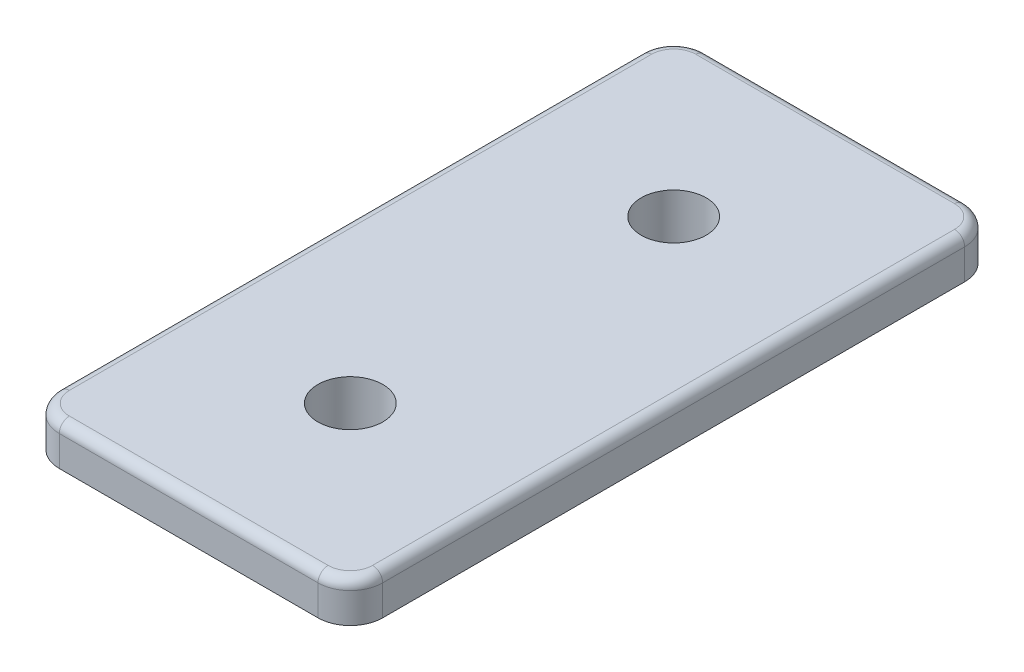
ISO-10303-21;
HEADER;
FILE_DESCRIPTION(('STEP AP214'),'2;1');
FILE_NAME('part.step','',(''),(''),'','','');
FILE_SCHEMA(('AUTOMOTIVE_DESIGN { 1 0 10303 214 1 1 1 1 }'));
ENDSEC;
DATA;
#1=APPLICATION_CONTEXT('core data for automotive mechanical design processes');
#2=APPLICATION_PROTOCOL_DEFINITION('international standard','automotive_design',2000,#1);
#3=PRODUCT_CONTEXT('',#1,'mechanical');
#4=PRODUCT('Part','Part','',(#3));
#5=PRODUCT_RELATED_PRODUCT_CATEGORY('part','',(#4));
#6=PRODUCT_DEFINITION_FORMATION('','',#4);
#7=PRODUCT_DEFINITION_CONTEXT('part definition',#1,'design');
#8=PRODUCT_DEFINITION('design','',#6,#7);
#9=PRODUCT_DEFINITION_SHAPE('','',#8);
#10=(LENGTH_UNIT() NAMED_UNIT(*) SI_UNIT(.MILLI.,.METRE.));
#11=(NAMED_UNIT(*) PLANE_ANGLE_UNIT() SI_UNIT($,.RADIAN.));
#12=(NAMED_UNIT(*) SI_UNIT($,.STERADIAN.) SOLID_ANGLE_UNIT());
#13=UNCERTAINTY_MEASURE_WITH_UNIT(LENGTH_MEASURE(1.E-05),#10,'distance_accuracy_value','');
#14=(GEOMETRIC_REPRESENTATION_CONTEXT(3) GLOBAL_UNCERTAINTY_ASSIGNED_CONTEXT((#13)) GLOBAL_UNIT_ASSIGNED_CONTEXT((#10,
#11,#12)) REPRESENTATION_CONTEXT('',''));
#15=CARTESIAN_POINT('',(0.,0.,0.));
#16=DIRECTION('',(0.,0.,1.));
#17=DIRECTION('',(1.,0.,0.));
#18=AXIS2_PLACEMENT_3D('',#15,#16,#17);
#19=CARTESIAN_POINT('',(-10.8585,0.762,0.));
#20=DIRECTION('',(-1.,0.,0.));
#21=DIRECTION('',(0.,0.,1.));
#22=AXIS2_PLACEMENT_3D('',#19,#20,#21);
#23=PLANE('',#22);
#24=DIRECTION('',(0.,0.,-1.));
#25=VECTOR('',#24,1.);
#26=CARTESIAN_POINT('',(-10.8585,0.,0.));
#27=LINE('',#26,#25);
#28=CARTESIAN_POINT('',(-10.8585,0.,21.0185));
#29=VERTEX_POINT('',#28);
#30=CARTESIAN_POINT('',(-10.8585,0.,-21.0185));
#31=VERTEX_POINT('',#30);
#32=EDGE_CURVE('E204',#29,#31,#27,.T.);
#33=ORIENTED_EDGE('',*,*,#32,.F.);
#34=DIRECTION('',(0.,-1.,0.));
#35=VECTOR('',#34,1.);
#36=CARTESIAN_POINT('',(-10.8585,0.762,21.0185));
#37=LINE('',#36,#35);
#38=CARTESIAN_POINT('',(-10.8585,0.762,21.0185));
#39=VERTEX_POINT('',#38);
#40=EDGE_CURVE('E182',#29,#39,#37,.F.);
#41=ORIENTED_EDGE('',*,*,#40,.T.);
#42=DIRECTION('',(0.,0.,-1.));
#43=VECTOR('',#42,1.);
#44=CARTESIAN_POINT('',(-10.8585,0.762,0.));
#45=LINE('',#44,#43);
#46=CARTESIAN_POINT('',(-10.8585,0.762,-21.0185));
#47=VERTEX_POINT('',#46);
#48=EDGE_CURVE('E215',#39,#47,#45,.T.);
#49=ORIENTED_EDGE('',*,*,#48,.T.);
#50=DIRECTION('',(0.,-1.,0.));
#51=VECTOR('',#50,1.);
#52=CARTESIAN_POINT('',(-10.8585,0.762,-21.0185));
#53=LINE('',#52,#51);
#54=EDGE_CURVE('E187',#47,#31,#53,.T.);
#55=ORIENTED_EDGE('',*,*,#54,.T.);
#56=EDGE_LOOP('',(#33,#41,#49,#55));
#57=FACE_BOUND('',#56,.T.);
#58=ADVANCED_FACE('F38',(#57),#23,.T.);
#59=CARTESIAN_POINT('',(0.,0.762,23.5585));
#60=DIRECTION('',(0.,0.,-1.));
#61=DIRECTION('',(-1.,0.,0.));
#62=AXIS2_PLACEMENT_3D('',#59,#60,#61);
#63=PLANE('',#62);
#64=DIRECTION('',(1.,0.,0.));
#65=VECTOR('',#64,1.);
#66=CARTESIAN_POINT('',(0.,0.762,23.5585));
#67=LINE('',#66,#65);
#68=CARTESIAN_POINT('',(-8.3185,0.762,23.5585));
#69=VERTEX_POINT('',#68);
#70=CARTESIAN_POINT('',(8.3185,0.762,23.5585));
#71=VERTEX_POINT('',#70);
#72=EDGE_CURVE('E197',#69,#71,#67,.T.);
#73=ORIENTED_EDGE('',*,*,#72,.F.);
#74=DIRECTION('',(0.,-1.,0.));
#75=VECTOR('',#74,1.);
#76=CARTESIAN_POINT('',(-8.3185,0.,23.5585));
#77=LINE('',#76,#75);
#78=CARTESIAN_POINT('',(-8.3185,0.,23.5585));
#79=VERTEX_POINT('',#78);
#80=EDGE_CURVE('E181',#69,#79,#77,.T.);
#81=ORIENTED_EDGE('',*,*,#80,.T.);
#82=DIRECTION('',(1.,0.,0.));
#83=VECTOR('',#82,1.);
#84=CARTESIAN_POINT('',(0.,0.,23.5585));
#85=LINE('',#84,#83);
#86=CARTESIAN_POINT('',(8.3185,0.,23.5585));
#87=VERTEX_POINT('',#86);
#88=EDGE_CURVE('E194',#79,#87,#85,.T.);
#89=ORIENTED_EDGE('',*,*,#88,.T.);
#90=DIRECTION('',(0.,-1.,0.));
#91=VECTOR('',#90,1.);
#92=CARTESIAN_POINT('',(8.3185,0.762,23.5585));
#93=LINE('',#92,#91);
#94=EDGE_CURVE('E199',#87,#71,#93,.F.);
#95=ORIENTED_EDGE('',*,*,#94,.T.);
#96=EDGE_LOOP('',(#73,#81,#89,#95));
#97=FACE_BOUND('',#96,.T.);
#98=ADVANCED_FACE('F193',(#97),#63,.F.);
#99=CARTESIAN_POINT('',(10.8585,0.762,0.));
#100=DIRECTION('',(-1.,0.,0.));
#101=DIRECTION('',(0.,0.,1.));
#102=AXIS2_PLACEMENT_3D('',#99,#100,#101);
#103=PLANE('',#102);
#104=DIRECTION('',(0.,0.,-1.));
#105=VECTOR('',#104,1.);
#106=CARTESIAN_POINT('',(10.8585,0.762,0.));
#107=LINE('',#106,#105);
#108=CARTESIAN_POINT('',(10.8585,0.762,21.0185));
#109=VERTEX_POINT('',#108);
#110=CARTESIAN_POINT('',(10.8585,0.762,-21.0185));
#111=VERTEX_POINT('',#110);
#112=EDGE_CURVE('E350',#109,#111,#107,.T.);
#113=ORIENTED_EDGE('',*,*,#112,.F.);
#114=DIRECTION('',(0.,-1.,0.));
#115=VECTOR('',#114,1.);
#116=CARTESIAN_POINT('',(10.8585,0.762,21.0185));
#117=LINE('',#116,#115);
#118=CARTESIAN_POINT('',(10.8585,0.,21.0185));
#119=VERTEX_POINT('',#118);
#120=EDGE_CURVE('E227',#109,#119,#117,.T.);
#121=ORIENTED_EDGE('',*,*,#120,.T.);
#122=DIRECTION('',(0.,0.,-1.));
#123=VECTOR('',#122,1.);
#124=CARTESIAN_POINT('',(10.8585,0.,0.));
#125=LINE('',#124,#123);
#126=CARTESIAN_POINT('',(10.8585,0.,-21.0185));
#127=VERTEX_POINT('',#126);
#128=EDGE_CURVE('E203',#119,#127,#125,.T.);
#129=ORIENTED_EDGE('',*,*,#128,.T.);
#130=DIRECTION('',(0.,-1.,0.));
#131=VECTOR('',#130,1.);
#132=CARTESIAN_POINT('',(10.8585,0.762,-21.0185));
#133=LINE('',#132,#131);
#134=EDGE_CURVE('E225',#127,#111,#133,.F.);
#135=ORIENTED_EDGE('',*,*,#134,.T.);
#136=EDGE_LOOP('',(#113,#121,#129,#135));
#137=FACE_BOUND('',#136,.T.);
#138=ADVANCED_FACE('F367',(#137),#103,.F.);
#139=CARTESIAN_POINT('',(0.,0.762,-23.5585));
#140=DIRECTION('',(0.,0.,-1.));
#141=DIRECTION('',(-1.,0.,0.));
#142=AXIS2_PLACEMENT_3D('',#139,#140,#141);
#143=PLANE('',#142);
#144=DIRECTION('',(1.,0.,0.));
#145=VECTOR('',#144,1.);
#146=CARTESIAN_POINT('',(0.,0.,-23.5585));
#147=LINE('',#146,#145);
#148=CARTESIAN_POINT('',(-8.3185,0.,-23.5585));
#149=VERTEX_POINT('',#148);
#150=CARTESIAN_POINT('',(8.31849999999999,0.,-23.5585));
#151=VERTEX_POINT('',#150);
#152=EDGE_CURVE('E207',#149,#151,#147,.T.);
#153=ORIENTED_EDGE('',*,*,#152,.F.);
#154=DIRECTION('',(0.,-1.,0.));
#155=VECTOR('',#154,1.);
#156=CARTESIAN_POINT('',(-8.3185,0.762,-23.5585));
#157=LINE('',#156,#155);
#158=CARTESIAN_POINT('',(-8.3185,0.762,-23.5585));
#159=VERTEX_POINT('',#158);
#160=EDGE_CURVE('E233',#149,#159,#157,.F.);
#161=ORIENTED_EDGE('',*,*,#160,.T.);
#162=DIRECTION('',(1.,0.,0.));
#163=VECTOR('',#162,1.);
#164=CARTESIAN_POINT('',(0.,0.762,-23.5585));
#165=LINE('',#164,#163);
#166=CARTESIAN_POINT('',(8.31849999999999,0.762,-23.5585));
#167=VERTEX_POINT('',#166);
#168=EDGE_CURVE('E216',#159,#167,#165,.T.);
#169=ORIENTED_EDGE('',*,*,#168,.T.);
#170=DIRECTION('',(0.,-1.,0.));
#171=VECTOR('',#170,1.);
#172=CARTESIAN_POINT('',(8.31849999999999,0.,-23.5585));
#173=LINE('',#172,#171);
#174=EDGE_CURVE('E230',#167,#151,#173,.T.);
#175=ORIENTED_EDGE('',*,*,#174,.T.);
#176=EDGE_LOOP('',(#153,#161,#169,#175));
#177=FACE_BOUND('',#176,.T.);
#178=ADVANCED_FACE('F357',(#177),#143,.T.);
#179=CARTESIAN_POINT('',(0.,0.,0.));
#180=DIRECTION('',(0.,1.,0.));
#181=DIRECTION('',(0.,0.,1.));
#182=AXIS2_PLACEMENT_3D('',#179,#180,#181);
#183=PLANE('',#182);
#184=CARTESIAN_POINT('',(0.,0.,-12.7));
#185=DIRECTION('',(0.,1.,0.));
#186=DIRECTION('',(0.,0.,1.));
#187=AXIS2_PLACEMENT_3D('',#184,#185,#186);
#188=CIRCLE('',#187,2.5527);
#189=CARTESIAN_POINT('',(0.,0.,-10.1473));
#190=VERTEX_POINT('',#189);
#191=EDGE_CURVE('E339',#190,#190,#188,.T.);
#192=ORIENTED_EDGE('',*,*,#191,.T.);
#193=EDGE_LOOP('',(#192));
#194=FACE_BOUND('',#193,.T.);
#195=CARTESIAN_POINT('',(0.,0.,12.7));
#196=DIRECTION('',(0.,1.,0.));
#197=DIRECTION('',(0.,0.,-1.));
#198=AXIS2_PLACEMENT_3D('',#195,#196,#197);
#199=CIRCLE('',#198,2.5527);
#200=CARTESIAN_POINT('',(0.,0.,10.1473));
#201=VERTEX_POINT('',#200);
#202=EDGE_CURVE('E326',#201,#201,#199,.T.);
#203=ORIENTED_EDGE('',*,*,#202,.T.);
#204=EDGE_LOOP('',(#203));
#205=FACE_BOUND('',#204,.T.);
#206=ORIENTED_EDGE('',*,*,#88,.F.);
#207=CARTESIAN_POINT('',(-8.3185,0.,21.0185));
#208=DIRECTION('',(0.,1.,0.));
#209=DIRECTION('',(0.,0.,1.));
#210=AXIS2_PLACEMENT_3D('',#207,#208,#209);
#211=CIRCLE('',#210,2.54);
#212=EDGE_CURVE('E177',#79,#29,#211,.F.);
#213=ORIENTED_EDGE('',*,*,#212,.T.);
#214=ORIENTED_EDGE('',*,*,#32,.T.);
#215=CARTESIAN_POINT('',(-8.3185,0.,-21.0185));
#216=DIRECTION('',(0.,1.,0.));
#217=DIRECTION('',(0.,0.,1.));
#218=AXIS2_PLACEMENT_3D('',#215,#216,#217);
#219=CIRCLE('',#218,2.54);
#220=EDGE_CURVE('E219',#31,#149,#219,.F.);
#221=ORIENTED_EDGE('',*,*,#220,.T.);
#222=ORIENTED_EDGE('',*,*,#152,.T.);
#223=CARTESIAN_POINT('',(8.31849999999999,0.,-21.0185));
#224=DIRECTION('',(0.,1.,0.));
#225=DIRECTION('',(0.,0.,1.));
#226=AXIS2_PLACEMENT_3D('',#223,#224,#225);
#227=CIRCLE('',#226,2.54);
#228=EDGE_CURVE('E198',#151,#127,#227,.F.);
#229=ORIENTED_EDGE('',*,*,#228,.T.);
#230=ORIENTED_EDGE('',*,*,#128,.F.);
#231=CARTESIAN_POINT('',(8.3185,0.,21.0185));
#232=DIRECTION('',(0.,1.,0.));
#233=DIRECTION('',(0.,0.,1.));
#234=AXIS2_PLACEMENT_3D('',#231,#232,#233);
#235=CIRCLE('',#234,2.54);
#236=EDGE_CURVE('E188',#119,#87,#235,.F.);
#237=ORIENTED_EDGE('',*,*,#236,.T.);
#238=EDGE_LOOP('',(#206,#213,#214,#221,#222,#229,#230,#237));
#239=FACE_BOUND('',#238,.T.);
#240=ADVANCED_FACE('F201',(#194,#205,#239),#183,.F.);
#241=CARTESIAN_POINT('',(0.,0.762,0.));
#242=DIRECTION('',(0.,-1.,0.));
#243=DIRECTION('',(0.,0.,-1.));
#244=AXIS2_PLACEMENT_3D('',#241,#242,#243);
#245=PLANE('',#244);
#246=DIRECTION('',(-1.,0.,0.));
#247=VECTOR('',#246,1.);
#248=CARTESIAN_POINT('',(-12.7,0.762,-25.4));
#249=LINE('',#248,#247);
#250=CARTESIAN_POINT('',(10.16,0.762,-25.4));
#251=VERTEX_POINT('',#250);
#252=CARTESIAN_POINT('',(-10.16,0.762,-25.4));
#253=VERTEX_POINT('',#252);
#254=EDGE_CURVE('E338',#251,#253,#249,.T.);
#255=ORIENTED_EDGE('',*,*,#254,.F.);
#256=CARTESIAN_POINT('',(10.16,0.762,-22.86));
#257=DIRECTION('',(0.,-1.,0.));
#258=DIRECTION('',(0.,0.,-1.));
#259=AXIS2_PLACEMENT_3D('',#256,#257,#258);
#260=CIRCLE('',#259,2.54);
#261=CARTESIAN_POINT('',(12.7,0.762,-22.86));
#262=VERTEX_POINT('',#261);
#263=EDGE_CURVE('E246',#251,#262,#260,.T.);
#264=ORIENTED_EDGE('',*,*,#263,.T.);
#265=DIRECTION('',(0.,0.,-1.));
#266=VECTOR('',#265,1.);
#267=CARTESIAN_POINT('',(12.7,0.762,25.4));
#268=LINE('',#267,#266);
#269=CARTESIAN_POINT('',(12.7,0.762,22.86));
#270=VERTEX_POINT('',#269);
#271=EDGE_CURVE('E335',#270,#262,#268,.T.);
#272=ORIENTED_EDGE('',*,*,#271,.F.);
#273=CARTESIAN_POINT('',(10.16,0.762,22.86));
#274=DIRECTION('',(0.,-1.,0.));
#275=DIRECTION('',(0.,0.,-1.));
#276=AXIS2_PLACEMENT_3D('',#273,#274,#275);
#277=CIRCLE('',#276,2.54);
#278=CARTESIAN_POINT('',(10.16,0.762,25.4));
#279=VERTEX_POINT('',#278);
#280=EDGE_CURVE('E244',#270,#279,#277,.T.);
#281=ORIENTED_EDGE('',*,*,#280,.T.);
#282=DIRECTION('',(1.,0.,0.));
#283=VECTOR('',#282,1.);
#284=CARTESIAN_POINT('',(-12.7,0.762,25.4));
#285=LINE('',#284,#283);
#286=CARTESIAN_POINT('',(-10.16,0.762,25.4));
#287=VERTEX_POINT('',#286);
#288=EDGE_CURVE('E209',#287,#279,#285,.T.);
#289=ORIENTED_EDGE('',*,*,#288,.F.);
#290=CARTESIAN_POINT('',(-10.16,0.762,22.86));
#291=DIRECTION('',(0.,-1.,0.));
#292=DIRECTION('',(0.,0.,-1.));
#293=AXIS2_PLACEMENT_3D('',#290,#291,#292);
#294=CIRCLE('',#293,2.54);
#295=CARTESIAN_POINT('',(-12.7,0.762,22.86));
#296=VERTEX_POINT('',#295);
#297=EDGE_CURVE('E240',#287,#296,#294,.T.);
#298=ORIENTED_EDGE('',*,*,#297,.T.);
#299=DIRECTION('',(0.,0.,1.));
#300=VECTOR('',#299,1.);
#301=CARTESIAN_POINT('',(-12.7,0.762,25.4));
#302=LINE('',#301,#300);
#303=CARTESIAN_POINT('',(-12.7,0.762,-22.86));
#304=VERTEX_POINT('',#303);
#305=EDGE_CURVE('E342',#304,#296,#302,.T.);
#306=ORIENTED_EDGE('',*,*,#305,.F.);
#307=CARTESIAN_POINT('',(-10.16,0.762,-22.86));
#308=DIRECTION('',(0.,-1.,0.));
#309=DIRECTION('',(0.,0.,-1.));
#310=AXIS2_PLACEMENT_3D('',#307,#308,#309);
#311=CIRCLE('',#310,2.54);
#312=EDGE_CURVE('E242',#304,#253,#311,.T.);
#313=ORIENTED_EDGE('',*,*,#312,.T.);
#314=EDGE_LOOP('',(#255,#264,#272,#281,#289,#298,#306,#313));
#315=FACE_BOUND('',#314,.T.);
#316=ORIENTED_EDGE('',*,*,#48,.F.);
#317=CARTESIAN_POINT('',(-8.3185,0.762,21.0185));
#318=DIRECTION('',(0.,-1.,0.));
#319=DIRECTION('',(0.,0.,-1.));
#320=AXIS2_PLACEMENT_3D('',#317,#318,#319);
#321=CIRCLE('',#320,2.54);
#322=EDGE_CURVE('E261',#39,#69,#321,.F.);
#323=ORIENTED_EDGE('',*,*,#322,.T.);
#324=ORIENTED_EDGE('',*,*,#72,.T.);
#325=CARTESIAN_POINT('',(8.3185,0.762,21.0185));
#326=DIRECTION('',(0.,-1.,0.));
#327=DIRECTION('',(0.,0.,-1.));
#328=AXIS2_PLACEMENT_3D('',#325,#326,#327);
#329=CIRCLE('',#328,2.54);
#330=EDGE_CURVE('E263',#71,#109,#329,.F.);
#331=ORIENTED_EDGE('',*,*,#330,.T.);
#332=ORIENTED_EDGE('',*,*,#112,.T.);
#333=CARTESIAN_POINT('',(8.31849999999999,0.762,-21.0185));
#334=DIRECTION('',(0.,-1.,0.));
#335=DIRECTION('',(0.,0.,-1.));
#336=AXIS2_PLACEMENT_3D('',#333,#334,#335);
#337=CIRCLE('',#336,2.54);
#338=EDGE_CURVE('E267',#111,#167,#337,.F.);
#339=ORIENTED_EDGE('',*,*,#338,.T.);
#340=ORIENTED_EDGE('',*,*,#168,.F.);
#341=CARTESIAN_POINT('',(-8.3185,0.762,-21.0185));
#342=DIRECTION('',(0.,-1.,0.));
#343=DIRECTION('',(0.,0.,-1.));
#344=AXIS2_PLACEMENT_3D('',#341,#342,#343);
#345=CIRCLE('',#344,2.54);
#346=EDGE_CURVE('E265',#159,#47,#345,.F.);
#347=ORIENTED_EDGE('',*,*,#346,.T.);
#348=EDGE_LOOP('',(#316,#323,#324,#331,#332,#339,#340,#347));
#349=FACE_BOUND('',#348,.T.);
#350=ADVANCED_FACE('F373',(#315,#349),#245,.T.);
#351=CARTESIAN_POINT('',(12.7,3.937,25.4));
#352=DIRECTION('',(-1.,0.,0.));
#353=DIRECTION('',(0.,0.,1.));
#354=AXIS2_PLACEMENT_3D('',#351,#352,#353);
#355=PLANE('',#354);
#356=DIRECTION('',(0.,-1.,0.));
#357=VECTOR('',#356,1.);
#358=CARTESIAN_POINT('',(12.7,3.937,-22.86));
#359=LINE('',#358,#357);
#360=CARTESIAN_POINT('',(12.7,3.14325,-22.86));
#361=VERTEX_POINT('',#360);
#362=EDGE_CURVE('E250',#262,#361,#359,.F.);
#363=ORIENTED_EDGE('',*,*,#362,.T.);
#364=DIRECTION('',(0.,0.,-1.));
#365=VECTOR('',#364,1.);
#366=CARTESIAN_POINT('',(12.7,3.14325,25.4));
#367=LINE('',#366,#365);
#368=CARTESIAN_POINT('',(12.7,3.14325,22.86));
#369=VERTEX_POINT('',#368);
#370=EDGE_CURVE('E293',#361,#369,#367,.F.);
#371=ORIENTED_EDGE('',*,*,#370,.T.);
#372=DIRECTION('',(0.,-1.,0.));
#373=VECTOR('',#372,1.);
#374=CARTESIAN_POINT('',(12.7,3.937,22.86));
#375=LINE('',#374,#373);
#376=EDGE_CURVE('E248',#369,#270,#375,.T.);
#377=ORIENTED_EDGE('',*,*,#376,.T.);
#378=ORIENTED_EDGE('',*,*,#271,.T.);
#379=EDGE_LOOP('',(#363,#371,#377,#378));
#380=FACE_BOUND('',#379,.T.);
#381=ADVANCED_FACE('F418',(#380),#355,.F.);
#382=CARTESIAN_POINT('',(-12.7,3.937,-25.4));
#383=DIRECTION('',(0.,0.,1.));
#384=DIRECTION('',(1.,0.,0.));
#385=AXIS2_PLACEMENT_3D('',#382,#383,#384);
#386=PLANE('',#385);
#387=DIRECTION('',(0.,-1.,0.));
#388=VECTOR('',#387,1.);
#389=CARTESIAN_POINT('',(-10.16,3.937,-25.4));
#390=LINE('',#389,#388);
#391=CARTESIAN_POINT('',(-10.16,3.14325,-25.4));
#392=VERTEX_POINT('',#391);
#393=EDGE_CURVE('E235',#253,#392,#390,.F.);
#394=ORIENTED_EDGE('',*,*,#393,.T.);
#395=DIRECTION('',(-1.,0.,0.));
#396=VECTOR('',#395,1.);
#397=CARTESIAN_POINT('',(-12.7,3.14325,-25.4));
#398=LINE('',#397,#396);
#399=CARTESIAN_POINT('',(10.16,3.14325,-25.4));
#400=VERTEX_POINT('',#399);
#401=EDGE_CURVE('E289',#392,#400,#398,.F.);
#402=ORIENTED_EDGE('',*,*,#401,.T.);
#403=DIRECTION('',(0.,-1.,0.));
#404=VECTOR('',#403,1.);
#405=CARTESIAN_POINT('',(10.16,3.937,-25.4));
#406=LINE('',#405,#404);
#407=EDGE_CURVE('E238',#400,#251,#406,.T.);
#408=ORIENTED_EDGE('',*,*,#407,.T.);
#409=ORIENTED_EDGE('',*,*,#254,.T.);
#410=EDGE_LOOP('',(#394,#402,#408,#409));
#411=FACE_BOUND('',#410,.T.);
#412=ADVANCED_FACE('F425',(#411),#386,.F.);
#413=CARTESIAN_POINT('',(-12.7,3.937,25.4));
#414=DIRECTION('',(1.,0.,0.));
#415=DIRECTION('',(0.,0.,-1.));
#416=AXIS2_PLACEMENT_3D('',#413,#414,#415);
#417=PLANE('',#416);
#418=DIRECTION('',(0.,-1.,0.));
#419=VECTOR('',#418,1.);
#420=CARTESIAN_POINT('',(-12.7,3.937,22.86));
#421=LINE('',#420,#419);
#422=CARTESIAN_POINT('',(-12.7,3.14325,22.86));
#423=VERTEX_POINT('',#422);
#424=EDGE_CURVE('E257',#296,#423,#421,.F.);
#425=ORIENTED_EDGE('',*,*,#424,.T.);
#426=DIRECTION('',(0.,0.,1.));
#427=VECTOR('',#426,1.);
#428=CARTESIAN_POINT('',(-12.7,3.14325,25.4));
#429=LINE('',#428,#427);
#430=CARTESIAN_POINT('',(-12.7,3.14325,-22.86));
#431=VERTEX_POINT('',#430);
#432=EDGE_CURVE('E11',#423,#431,#429,.F.);
#433=ORIENTED_EDGE('',*,*,#432,.T.);
#434=DIRECTION('',(0.,-1.,0.));
#435=VECTOR('',#434,1.);
#436=CARTESIAN_POINT('',(-12.7,3.937,-22.86));
#437=LINE('',#436,#435);
#438=EDGE_CURVE('E259',#431,#304,#437,.T.);
#439=ORIENTED_EDGE('',*,*,#438,.T.);
#440=ORIENTED_EDGE('',*,*,#305,.T.);
#441=EDGE_LOOP('',(#425,#433,#439,#440));
#442=FACE_BOUND('',#441,.T.);
#443=ADVANCED_FACE('F422',(#442),#417,.F.);
#444=CARTESIAN_POINT('',(-12.7,3.937,25.4));
#445=DIRECTION('',(0.,0.,-1.));
#446=DIRECTION('',(-1.,0.,0.));
#447=AXIS2_PLACEMENT_3D('',#444,#445,#446);
#448=PLANE('',#447);
#449=DIRECTION('',(0.,-1.,0.));
#450=VECTOR('',#449,1.);
#451=CARTESIAN_POINT('',(10.16,3.937,25.4));
#452=LINE('',#451,#450);
#453=CARTESIAN_POINT('',(10.16,3.14325,25.4));
#454=VERTEX_POINT('',#453);
#455=EDGE_CURVE('E255',#279,#454,#452,.F.);
#456=ORIENTED_EDGE('',*,*,#455,.T.);
#457=DIRECTION('',(1.,0.,0.));
#458=VECTOR('',#457,1.);
#459=CARTESIAN_POINT('',(-12.7,3.14325,25.4));
#460=LINE('',#459,#458);
#461=CARTESIAN_POINT('',(-10.16,3.14325,25.4));
#462=VERTEX_POINT('',#461);
#463=EDGE_CURVE('E62',#454,#462,#460,.F.);
#464=ORIENTED_EDGE('',*,*,#463,.T.);
#465=DIRECTION('',(0.,-1.,0.));
#466=VECTOR('',#465,1.);
#467=CARTESIAN_POINT('',(-10.16,3.937,25.4));
#468=LINE('',#467,#466);
#469=EDGE_CURVE('E253',#462,#287,#468,.T.);
#470=ORIENTED_EDGE('',*,*,#469,.T.);
#471=ORIENTED_EDGE('',*,*,#288,.T.);
#472=EDGE_LOOP('',(#456,#464,#470,#471));
#473=FACE_BOUND('',#472,.T.);
#474=ADVANCED_FACE('F414',(#473),#448,.F.);
#475=CARTESIAN_POINT('',(0.,3.937,0.));
#476=DIRECTION('',(0.,-1.,0.));
#477=DIRECTION('',(0.,0.,-1.));
#478=AXIS2_PLACEMENT_3D('',#475,#476,#477);
#479=PLANE('',#478);
#480=DIRECTION('',(-1.,0.,0.));
#481=VECTOR('',#480,1.);
#482=CARTESIAN_POINT('',(0.,3.937,-24.60625));
#483=LINE('',#482,#481);
#484=CARTESIAN_POINT('',(10.16,3.937,-24.60625));
#485=VERTEX_POINT('',#484);
#486=CARTESIAN_POINT('',(-10.16,3.937,-24.60625));
#487=VERTEX_POINT('',#486);
#488=EDGE_CURVE('E281',#485,#487,#483,.T.);
#489=ORIENTED_EDGE('',*,*,#488,.T.);
#490=CARTESIAN_POINT('',(-10.16,3.937,-22.86));
#491=DIRECTION('',(0.,-1.,0.));
#492=DIRECTION('',(0.,0.,-1.));
#493=AXIS2_PLACEMENT_3D('',#490,#491,#492);
#494=CIRCLE('',#493,1.74625);
#495=CARTESIAN_POINT('',(-11.90625,3.937,-22.86));
#496=VERTEX_POINT('',#495);
#497=EDGE_CURVE('E283',#487,#496,#494,.F.);
#498=ORIENTED_EDGE('',*,*,#497,.T.);
#499=DIRECTION('',(0.,0.,1.));
#500=VECTOR('',#499,1.);
#501=CARTESIAN_POINT('',(-11.90625,3.937,0.));
#502=LINE('',#501,#500);
#503=CARTESIAN_POINT('',(-11.90625,3.937,22.86));
#504=VERTEX_POINT('',#503);
#505=EDGE_CURVE('E269',#496,#504,#502,.T.);
#506=ORIENTED_EDGE('',*,*,#505,.T.);
#507=CARTESIAN_POINT('',(-10.16,3.937,22.86));
#508=DIRECTION('',(0.,-1.,0.));
#509=DIRECTION('',(0.,0.,-1.));
#510=AXIS2_PLACEMENT_3D('',#507,#508,#509);
#511=CIRCLE('',#510,1.74625);
#512=CARTESIAN_POINT('',(-10.16,3.937,24.60625));
#513=VERTEX_POINT('',#512);
#514=EDGE_CURVE('E271',#504,#513,#511,.F.);
#515=ORIENTED_EDGE('',*,*,#514,.T.);
#516=DIRECTION('',(1.,0.,0.));
#517=VECTOR('',#516,1.);
#518=CARTESIAN_POINT('',(0.,3.937,24.60625));
#519=LINE('',#518,#517);
#520=CARTESIAN_POINT('',(10.16,3.937,24.60625));
#521=VERTEX_POINT('',#520);
#522=EDGE_CURVE('E273',#513,#521,#519,.T.);
#523=ORIENTED_EDGE('',*,*,#522,.T.);
#524=CARTESIAN_POINT('',(10.16,3.937,22.86));
#525=DIRECTION('',(0.,-1.,0.));
#526=DIRECTION('',(0.,0.,-1.));
#527=AXIS2_PLACEMENT_3D('',#524,#525,#526);
#528=CIRCLE('',#527,1.74625);
#529=CARTESIAN_POINT('',(11.90625,3.937,22.86));
#530=VERTEX_POINT('',#529);
#531=EDGE_CURVE('E275',#521,#530,#528,.F.);
#532=ORIENTED_EDGE('',*,*,#531,.T.);
#533=DIRECTION('',(0.,0.,-1.));
#534=VECTOR('',#533,1.);
#535=CARTESIAN_POINT('',(11.90625,3.937,0.));
#536=LINE('',#535,#534);
#537=CARTESIAN_POINT('',(11.90625,3.937,-22.86));
#538=VERTEX_POINT('',#537);
#539=EDGE_CURVE('E277',#530,#538,#536,.T.);
#540=ORIENTED_EDGE('',*,*,#539,.T.);
#541=CARTESIAN_POINT('',(10.16,3.937,-22.86));
#542=DIRECTION('',(0.,-1.,0.));
#543=DIRECTION('',(0.,0.,-1.));
#544=AXIS2_PLACEMENT_3D('',#541,#542,#543);
#545=CIRCLE('',#544,1.74625);
#546=EDGE_CURVE('E279',#538,#485,#545,.F.);
#547=ORIENTED_EDGE('',*,*,#546,.T.);
#548=EDGE_LOOP('',(#489,#498,#506,#515,#523,#532,#540,#547));
#549=FACE_BOUND('',#548,.T.);
#550=CARTESIAN_POINT('',(0.,3.937,-12.7));
#551=DIRECTION('',(0.,1.,0.));
#552=DIRECTION('',(0.,0.,1.));
#553=AXIS2_PLACEMENT_3D('',#550,#551,#552);
#554=CIRCLE('',#553,2.5527);
#555=CARTESIAN_POINT('',(0.,3.937,-10.1473));
#556=VERTEX_POINT('',#555);
#557=EDGE_CURVE('E331',#556,#556,#554,.T.);
#558=ORIENTED_EDGE('',*,*,#557,.F.);
#559=EDGE_LOOP('',(#558));
#560=FACE_BOUND('',#559,.T.);
#561=CARTESIAN_POINT('',(0.,3.937,12.7));
#562=DIRECTION('',(0.,1.,0.));
#563=DIRECTION('',(0.,0.,-1.));
#564=AXIS2_PLACEMENT_3D('',#561,#562,#563);
#565=CIRCLE('',#564,2.5527);
#566=CARTESIAN_POINT('',(0.,3.937,10.1473));
#567=VERTEX_POINT('',#566);
#568=EDGE_CURVE('E320',#567,#567,#565,.T.);
#569=ORIENTED_EDGE('',*,*,#568,.F.);
#570=EDGE_LOOP('',(#569));
#571=FACE_BOUND('',#570,.T.);
#572=ADVANCED_FACE('F406',(#549,#560,#571),#479,.F.);
#573=CARTESIAN_POINT('',(0.,0.,12.7));
#574=DIRECTION('',(0.,1.,0.));
#575=DIRECTION('',(0.,0.,1.));
#576=AXIS2_PLACEMENT_3D('',#573,#574,#575);
#577=CYLINDRICAL_SURFACE('',#576,2.5527);
#578=ORIENTED_EDGE('',*,*,#202,.F.);
#579=EDGE_LOOP('',(#578));
#580=FACE_BOUND('',#579,.T.);
#581=ORIENTED_EDGE('',*,*,#568,.T.);
#582=EDGE_LOOP('',(#581));
#583=FACE_BOUND('',#582,.T.);
#584=ADVANCED_FACE('F400',(#580,#583),#577,.F.);
#585=CARTESIAN_POINT('',(0.,0.,-12.7));
#586=DIRECTION('',(0.,1.,0.));
#587=DIRECTION('',(0.,0.,1.));
#588=AXIS2_PLACEMENT_3D('',#585,#586,#587);
#589=CYLINDRICAL_SURFACE('',#588,2.5527);
#590=ORIENTED_EDGE('',*,*,#191,.F.);
#591=EDGE_LOOP('',(#590));
#592=FACE_BOUND('',#591,.T.);
#593=ORIENTED_EDGE('',*,*,#557,.T.);
#594=EDGE_LOOP('',(#593));
#595=FACE_BOUND('',#594,.T.);
#596=ADVANCED_FACE('F396',(#592,#595),#589,.F.);
#597=CARTESIAN_POINT('',(-8.3185,0.762,21.0185));
#598=DIRECTION('',(0.,1.,0.));
#599=DIRECTION('',(0.,0.,1.));
#600=AXIS2_PLACEMENT_3D('',#597,#598,#599);
#601=CYLINDRICAL_SURFACE('',#600,2.54);
#602=ORIENTED_EDGE('',*,*,#322,.F.);
#603=ORIENTED_EDGE('',*,*,#40,.F.);
#604=ORIENTED_EDGE('',*,*,#212,.F.);
#605=ORIENTED_EDGE('',*,*,#80,.F.);
#606=EDGE_LOOP('',(#602,#603,#604,#605));
#607=FACE_BOUND('',#606,.T.);
#608=ADVANCED_FACE('F180',(#607),#601,.T.);
#609=CARTESIAN_POINT('',(8.3185,0.762,21.0185));
#610=DIRECTION('',(0.,-1.,0.));
#611=DIRECTION('',(0.,0.,-1.));
#612=AXIS2_PLACEMENT_3D('',#609,#610,#611);
#613=CYLINDRICAL_SURFACE('',#612,2.54);
#614=ORIENTED_EDGE('',*,*,#330,.F.);
#615=ORIENTED_EDGE('',*,*,#94,.F.);
#616=ORIENTED_EDGE('',*,*,#236,.F.);
#617=ORIENTED_EDGE('',*,*,#120,.F.);
#618=EDGE_LOOP('',(#614,#615,#616,#617));
#619=FACE_BOUND('',#618,.T.);
#620=ADVANCED_FACE('F371',(#619),#613,.T.);
#621=CARTESIAN_POINT('',(-8.3185,0.762,-21.0185));
#622=DIRECTION('',(0.,-1.,0.));
#623=DIRECTION('',(0.,0.,-1.));
#624=AXIS2_PLACEMENT_3D('',#621,#622,#623);
#625=CYLINDRICAL_SURFACE('',#624,2.54);
#626=ORIENTED_EDGE('',*,*,#346,.F.);
#627=ORIENTED_EDGE('',*,*,#160,.F.);
#628=ORIENTED_EDGE('',*,*,#220,.F.);
#629=ORIENTED_EDGE('',*,*,#54,.F.);
#630=EDGE_LOOP('',(#626,#627,#628,#629));
#631=FACE_BOUND('',#630,.T.);
#632=ADVANCED_FACE('F377',(#631),#625,.T.);
#633=CARTESIAN_POINT('',(8.31849999999999,0.762,-21.0185));
#634=DIRECTION('',(0.,1.,0.));
#635=DIRECTION('',(0.,0.,1.));
#636=AXIS2_PLACEMENT_3D('',#633,#634,#635);
#637=CYLINDRICAL_SURFACE('',#636,2.54);
#638=ORIENTED_EDGE('',*,*,#338,.F.);
#639=ORIENTED_EDGE('',*,*,#134,.F.);
#640=ORIENTED_EDGE('',*,*,#228,.F.);
#641=ORIENTED_EDGE('',*,*,#174,.F.);
#642=EDGE_LOOP('',(#638,#639,#640,#641));
#643=FACE_BOUND('',#642,.T.);
#644=ADVANCED_FACE('F363',(#643),#637,.T.);
#645=CARTESIAN_POINT('',(10.16,3.937,-22.86));
#646=DIRECTION('',(0.,-1.,0.));
#647=DIRECTION('',(0.,0.,-1.));
#648=AXIS2_PLACEMENT_3D('',#645,#646,#647);
#649=CYLINDRICAL_SURFACE('',#648,2.54);
#650=ORIENTED_EDGE('',*,*,#407,.F.);
#651=CARTESIAN_POINT('',(10.16,3.14325,-22.86));
#652=DIRECTION('',(0.,-1.,0.));
#653=DIRECTION('',(0.,0.,-1.));
#654=AXIS2_PLACEMENT_3D('',#651,#652,#653);
#655=CIRCLE('',#654,2.54);
#656=EDGE_CURVE('E291',#400,#361,#655,.T.);
#657=ORIENTED_EDGE('',*,*,#656,.T.);
#658=ORIENTED_EDGE('',*,*,#362,.F.);
#659=ORIENTED_EDGE('',*,*,#263,.F.);
#660=EDGE_LOOP('',(#650,#657,#658,#659));
#661=FACE_BOUND('',#660,.T.);
#662=ADVANCED_FACE('F384',(#661),#649,.T.);
#663=CARTESIAN_POINT('',(10.16,3.937,22.86));
#664=DIRECTION('',(0.,-1.,0.));
#665=DIRECTION('',(0.,0.,-1.));
#666=AXIS2_PLACEMENT_3D('',#663,#664,#665);
#667=CYLINDRICAL_SURFACE('',#666,2.54);
#668=ORIENTED_EDGE('',*,*,#376,.F.);
#669=CARTESIAN_POINT('',(10.16,3.14325,22.86));
#670=DIRECTION('',(0.,-1.,0.));
#671=DIRECTION('',(0.,0.,-1.));
#672=AXIS2_PLACEMENT_3D('',#669,#670,#671);
#673=CIRCLE('',#672,2.54);
#674=EDGE_CURVE('E295',#369,#454,#673,.T.);
#675=ORIENTED_EDGE('',*,*,#674,.T.);
#676=ORIENTED_EDGE('',*,*,#455,.F.);
#677=ORIENTED_EDGE('',*,*,#280,.F.);
#678=EDGE_LOOP('',(#668,#675,#676,#677));
#679=FACE_BOUND('',#678,.T.);
#680=ADVANCED_FACE('F536',(#679),#667,.T.);
#681=CARTESIAN_POINT('',(-10.16,3.937,-22.86));
#682=DIRECTION('',(0.,-1.,0.));
#683=DIRECTION('',(0.,0.,-1.));
#684=AXIS2_PLACEMENT_3D('',#681,#682,#683);
#685=CYLINDRICAL_SURFACE('',#684,2.54);
#686=ORIENTED_EDGE('',*,*,#438,.F.);
#687=CARTESIAN_POINT('',(-10.16,3.14325,-22.86));
#688=DIRECTION('',(0.,-1.,0.));
#689=DIRECTION('',(0.,0.,-1.));
#690=AXIS2_PLACEMENT_3D('',#687,#688,#689);
#691=CIRCLE('',#690,2.54);
#692=EDGE_CURVE('E286',#431,#392,#691,.T.);
#693=ORIENTED_EDGE('',*,*,#692,.T.);
#694=ORIENTED_EDGE('',*,*,#393,.F.);
#695=ORIENTED_EDGE('',*,*,#312,.F.);
#696=EDGE_LOOP('',(#686,#693,#694,#695));
#697=FACE_BOUND('',#696,.T.);
#698=ADVANCED_FACE('F545',(#697),#685,.T.);
#699=CARTESIAN_POINT('',(-10.16,3.937,22.86));
#700=DIRECTION('',(0.,-1.,0.));
#701=DIRECTION('',(0.,0.,-1.));
#702=AXIS2_PLACEMENT_3D('',#699,#700,#701);
#703=CYLINDRICAL_SURFACE('',#702,2.54);
#704=ORIENTED_EDGE('',*,*,#469,.F.);
#705=CARTESIAN_POINT('',(-10.16,3.14325,22.86));
#706=DIRECTION('',(0.,-1.,0.));
#707=DIRECTION('',(0.,0.,-1.));
#708=AXIS2_PLACEMENT_3D('',#705,#706,#707);
#709=CIRCLE('',#708,2.54);
#710=EDGE_CURVE('E47',#462,#423,#709,.T.);
#711=ORIENTED_EDGE('',*,*,#710,.T.);
#712=ORIENTED_EDGE('',*,*,#424,.F.);
#713=ORIENTED_EDGE('',*,*,#297,.F.);
#714=EDGE_LOOP('',(#704,#711,#712,#713));
#715=FACE_BOUND('',#714,.T.);
#716=ADVANCED_FACE('F554',(#715),#703,.T.);
#717=CARTESIAN_POINT('',(10.16,3.14325,22.86));
#718=DIRECTION('',(0.,-1.,0.));
#719=DIRECTION('',(0.,0.,-1.));
#720=AXIS2_PLACEMENT_3D('',#717,#718,#719);
#721=TOROIDAL_SURFACE('',#720,1.74625,0.79375);
#722=CARTESIAN_POINT('',(10.16,3.14325,24.60625));
#723=DIRECTION('',(-1.,0.,0.));
#724=DIRECTION('',(0.,0.,1.));
#725=AXIS2_PLACEMENT_3D('',#722,#723,#724);
#726=CIRCLE('',#725,0.79375);
#727=EDGE_CURVE('E314',#454,#521,#726,.T.);
#728=ORIENTED_EDGE('',*,*,#727,.F.);
#729=ORIENTED_EDGE('',*,*,#674,.F.);
#730=CARTESIAN_POINT('',(11.90625,3.14325,22.86));
#731=DIRECTION('',(0.,0.,-1.));
#732=DIRECTION('',(-1.,0.,0.));
#733=AXIS2_PLACEMENT_3D('',#730,#731,#732);
#734=CIRCLE('',#733,0.79375);
#735=EDGE_CURVE('E42',#530,#369,#734,.T.);
#736=ORIENTED_EDGE('',*,*,#735,.F.);
#737=ORIENTED_EDGE('',*,*,#531,.F.);
#738=EDGE_LOOP('',(#728,#729,#736,#737));
#739=FACE_BOUND('',#738,.T.);
#740=ADVANCED_FACE('F40',(#739),#721,.T.);
#741=CARTESIAN_POINT('',(11.90625,3.14325,0.));
#742=DIRECTION('',(0.,0.,-1.));
#743=DIRECTION('',(-1.,0.,0.));
#744=AXIS2_PLACEMENT_3D('',#741,#742,#743);
#745=CYLINDRICAL_SURFACE('',#744,0.79375);
#746=ORIENTED_EDGE('',*,*,#735,.T.);
#747=ORIENTED_EDGE('',*,*,#370,.F.);
#748=CARTESIAN_POINT('',(11.90625,3.14325,-22.86));
#749=DIRECTION('',(0.,0.,-1.));
#750=DIRECTION('',(-1.,0.,0.));
#751=AXIS2_PLACEMENT_3D('',#748,#749,#750);
#752=CIRCLE('',#751,0.79375);
#753=EDGE_CURVE('E312',#538,#361,#752,.T.);
#754=ORIENTED_EDGE('',*,*,#753,.F.);
#755=ORIENTED_EDGE('',*,*,#539,.F.);
#756=EDGE_LOOP('',(#746,#747,#754,#755));
#757=FACE_BOUND('',#756,.T.);
#758=ADVANCED_FACE('F571',(#757),#745,.T.);
#759=CARTESIAN_POINT('',(0.,3.14325,24.60625));
#760=DIRECTION('',(1.,0.,0.));
#761=DIRECTION('',(0.,0.,-1.));
#762=AXIS2_PLACEMENT_3D('',#759,#760,#761);
#763=CYLINDRICAL_SURFACE('',#762,0.79375);
#764=ORIENTED_EDGE('',*,*,#727,.T.);
#765=ORIENTED_EDGE('',*,*,#522,.F.);
#766=CARTESIAN_POINT('',(-10.16,3.14325,24.60625));
#767=DIRECTION('',(-1.,0.,0.));
#768=DIRECTION('',(0.,0.,1.));
#769=AXIS2_PLACEMENT_3D('',#766,#767,#768);
#770=CIRCLE('',#769,0.79375);
#771=EDGE_CURVE('E309',#462,#513,#770,.T.);
#772=ORIENTED_EDGE('',*,*,#771,.F.);
#773=ORIENTED_EDGE('',*,*,#463,.F.);
#774=EDGE_LOOP('',(#764,#765,#772,#773));
#775=FACE_BOUND('',#774,.T.);
#776=ADVANCED_FACE('F582',(#775),#763,.T.);
#777=CARTESIAN_POINT('',(10.16,3.14325,-22.86));
#778=DIRECTION('',(0.,-1.,0.));
#779=DIRECTION('',(0.,0.,-1.));
#780=AXIS2_PLACEMENT_3D('',#777,#778,#779);
#781=TOROIDAL_SURFACE('',#780,1.74625,0.79375);
#782=ORIENTED_EDGE('',*,*,#753,.T.);
#783=ORIENTED_EDGE('',*,*,#656,.F.);
#784=CARTESIAN_POINT('',(10.16,3.14325,-24.60625));
#785=DIRECTION('',(-1.,0.,0.));
#786=DIRECTION('',(0.,0.,1.));
#787=AXIS2_PLACEMENT_3D('',#784,#785,#786);
#788=CIRCLE('',#787,0.79375);
#789=EDGE_CURVE('E306',#485,#400,#788,.T.);
#790=ORIENTED_EDGE('',*,*,#789,.F.);
#791=ORIENTED_EDGE('',*,*,#546,.F.);
#792=EDGE_LOOP('',(#782,#783,#790,#791));
#793=FACE_BOUND('',#792,.T.);
#794=ADVANCED_FACE('F589',(#793),#781,.T.);
#795=CARTESIAN_POINT('',(-10.16,3.14325,22.86));
#796=DIRECTION('',(0.,-1.,0.));
#797=DIRECTION('',(0.,0.,-1.));
#798=AXIS2_PLACEMENT_3D('',#795,#796,#797);
#799=TOROIDAL_SURFACE('',#798,1.74625,0.79375);
#800=ORIENTED_EDGE('',*,*,#771,.T.);
#801=ORIENTED_EDGE('',*,*,#514,.F.);
#802=CARTESIAN_POINT('',(-11.90625,3.14325,22.86));
#803=DIRECTION('',(0.,0.,-1.));
#804=DIRECTION('',(-1.,0.,0.));
#805=AXIS2_PLACEMENT_3D('',#802,#803,#804);
#806=CIRCLE('',#805,0.79375);
#807=EDGE_CURVE('E303',#423,#504,#806,.T.);
#808=ORIENTED_EDGE('',*,*,#807,.F.);
#809=ORIENTED_EDGE('',*,*,#710,.F.);
#810=EDGE_LOOP('',(#800,#801,#808,#809));
#811=FACE_BOUND('',#810,.T.);
#812=ADVANCED_FACE('F597',(#811),#799,.T.);
#813=CARTESIAN_POINT('',(0.,3.14325,-24.60625));
#814=DIRECTION('',(-1.,0.,0.));
#815=DIRECTION('',(0.,0.,1.));
#816=AXIS2_PLACEMENT_3D('',#813,#814,#815);
#817=CYLINDRICAL_SURFACE('',#816,0.79375);
#818=ORIENTED_EDGE('',*,*,#789,.T.);
#819=ORIENTED_EDGE('',*,*,#401,.F.);
#820=CARTESIAN_POINT('',(-10.16,3.14325,-24.60625));
#821=DIRECTION('',(-1.,0.,0.));
#822=DIRECTION('',(0.,0.,1.));
#823=AXIS2_PLACEMENT_3D('',#820,#821,#822);
#824=CIRCLE('',#823,0.79375);
#825=EDGE_CURVE('E301',#487,#392,#824,.T.);
#826=ORIENTED_EDGE('',*,*,#825,.F.);
#827=ORIENTED_EDGE('',*,*,#488,.F.);
#828=EDGE_LOOP('',(#818,#819,#826,#827));
#829=FACE_BOUND('',#828,.T.);
#830=ADVANCED_FACE('F608',(#829),#817,.T.);
#831=CARTESIAN_POINT('',(-11.90625,3.14325,0.));
#832=DIRECTION('',(0.,0.,1.));
#833=DIRECTION('',(1.,0.,0.));
#834=AXIS2_PLACEMENT_3D('',#831,#832,#833);
#835=CYLINDRICAL_SURFACE('',#834,0.79375);
#836=ORIENTED_EDGE('',*,*,#807,.T.);
#837=ORIENTED_EDGE('',*,*,#505,.F.);
#838=CARTESIAN_POINT('',(-11.90625,3.14325,-22.86));
#839=DIRECTION('',(0.,0.,-1.));
#840=DIRECTION('',(-1.,0.,0.));
#841=AXIS2_PLACEMENT_3D('',#838,#839,#840);
#842=CIRCLE('',#841,0.79375);
#843=EDGE_CURVE('E299',#431,#496,#842,.T.);
#844=ORIENTED_EDGE('',*,*,#843,.F.);
#845=ORIENTED_EDGE('',*,*,#432,.F.);
#846=EDGE_LOOP('',(#836,#837,#844,#845));
#847=FACE_BOUND('',#846,.T.);
#848=ADVANCED_FACE('F618',(#847),#835,.T.);
#849=CARTESIAN_POINT('',(-10.16,3.14325,-22.86));
#850=DIRECTION('',(0.,-1.,0.));
#851=DIRECTION('',(0.,0.,-1.));
#852=AXIS2_PLACEMENT_3D('',#849,#850,#851);
#853=TOROIDAL_SURFACE('',#852,1.74625,0.79375);
#854=ORIENTED_EDGE('',*,*,#825,.T.);
#855=ORIENTED_EDGE('',*,*,#692,.F.);
#856=ORIENTED_EDGE('',*,*,#843,.T.);
#857=ORIENTED_EDGE('',*,*,#497,.F.);
#858=EDGE_LOOP('',(#854,#855,#856,#857));
#859=FACE_BOUND('',#858,.T.);
#860=ADVANCED_FACE('F627',(#859),#853,.T.);
#861=CLOSED_SHELL('',(#58,#98,#138,#178,#240,#350,#381,#412,#443,#474,#572,#584,#596,#608,#620,
#632,#644,#662,#680,#698,#716,#740,#758,#776,#794,#812,#830,#848,#860));
#862=MANIFOLD_SOLID_BREP('B2',#861);
#863=ADVANCED_BREP_SHAPE_REPRESENTATION('',(#18,#862),#14);
#864=SHAPE_DEFINITION_REPRESENTATION(#9,#863);
ENDSEC;
END-ISO-10303-21;
